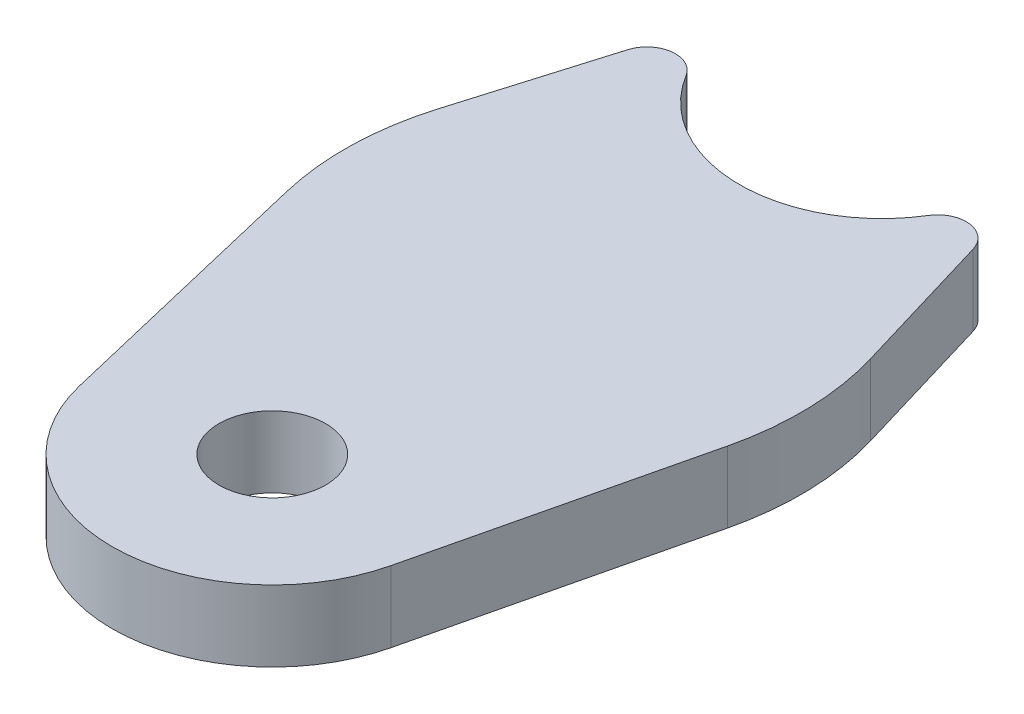
ISO-10303-21;
HEADER;
FILE_DESCRIPTION(('STEP AP214'),'2;1');
FILE_NAME('part.step','',(''),(''),'','','');
FILE_SCHEMA(('AUTOMOTIVE_DESIGN { 1 0 10303 214 1 1 1 1 }'));
ENDSEC;
DATA;
#1=APPLICATION_CONTEXT('core data for automotive mechanical design processes');
#2=APPLICATION_PROTOCOL_DEFINITION('international standard','automotive_design',2000,#1);
#3=PRODUCT_CONTEXT('',#1,'mechanical');
#4=PRODUCT('Part','Part','',(#3));
#5=PRODUCT_RELATED_PRODUCT_CATEGORY('part','',(#4));
#6=PRODUCT_DEFINITION_FORMATION('','',#4);
#7=PRODUCT_DEFINITION_CONTEXT('part definition',#1,'design');
#8=PRODUCT_DEFINITION('design','',#6,#7);
#9=PRODUCT_DEFINITION_SHAPE('','',#8);
#10=(LENGTH_UNIT() NAMED_UNIT(*) SI_UNIT(.MILLI.,.METRE.));
#11=(NAMED_UNIT(*) PLANE_ANGLE_UNIT() SI_UNIT($,.RADIAN.));
#12=(NAMED_UNIT(*) SI_UNIT($,.STERADIAN.) SOLID_ANGLE_UNIT());
#13=UNCERTAINTY_MEASURE_WITH_UNIT(LENGTH_MEASURE(1.E-05),#10,'distance_accuracy_value','');
#14=(GEOMETRIC_REPRESENTATION_CONTEXT(3) GLOBAL_UNCERTAINTY_ASSIGNED_CONTEXT((#13)) GLOBAL_UNIT_ASSIGNED_CONTEXT((#10,
#11,#12)) REPRESENTATION_CONTEXT('',''));
#15=CARTESIAN_POINT('',(0.,0.,0.));
#16=DIRECTION('',(0.,0.,1.));
#17=DIRECTION('',(1.,0.,0.));
#18=AXIS2_PLACEMENT_3D('',#15,#16,#17);
#19=CARTESIAN_POINT('',(0.,6.35,-54.4098725507521));
#20=DIRECTION('',(0.,1.,0.));
#21=DIRECTION('',(0.,0.,1.));
#22=AXIS2_PLACEMENT_3D('',#19,#20,#21);
#23=PLANE('',#22);
#24=DIRECTION('',(0.231494017970389,0.,-0.9728363272637));
#25=VECTOR('',#24,1.);
#26=CARTESIAN_POINT('',(21.2537497919373,6.35,-27.5986392399441));
#27=LINE('',#26,#25);
#28=CARTESIAN_POINT('',(13.8993990257801,6.35,3.30747078175193));
#29=VERTEX_POINT('',#28);
#30=CARTESIAN_POINT('',(19.6782224586751,6.35,-20.9776032501916));
#31=VERTEX_POINT('',#30);
#32=EDGE_CURVE('E172',#29,#31,#27,.T.);
#33=ORIENTED_EDGE('',*,*,#32,.T.);
#34=CARTESIAN_POINT('',(-5.03182025382286,6.35,-26.8575513066395));
#35=DIRECTION('',(0.,1.,0.));
#36=DIRECTION('',(0.,0.,1.));
#37=AXIS2_PLACEMENT_3D('',#34,#35,#36);
#38=CIRCLE('',#37,25.4);
#39=CARTESIAN_POINT('',(19.3076784920229,6.35,-34.1203882730718));
#40=VERTEX_POINT('',#39);
#41=EDGE_CURVE('E246',#31,#40,#38,.T.);
#42=ORIENTED_EDGE('',*,*,#41,.T.);
#43=DIRECTION('',(-0.285938463245363,0.,-0.95824798211991));
#44=VECTOR('',#43,1.);
#45=CARTESIAN_POINT('',(12.1697493729229,6.35,-58.0412910339682));
#46=LINE('',#45,#44);
#47=CARTESIAN_POINT('',(15.4177888062111,6.35,-47.1563362871718));
#48=VERTEX_POINT('',#47);
#49=EDGE_CURVE('E175',#40,#48,#46,.T.);
#50=ORIENTED_EDGE('',*,*,#49,.T.);
#51=CARTESIAN_POINT('',(12.9838389316265,6.35,-46.4300525905285));
#52=DIRECTION('',(0.,1.,0.));
#53=DIRECTION('',(0.,0.,1.));
#54=AXIS2_PLACEMENT_3D('',#51,#52,#53);
#55=CIRCLE('',#54,2.54);
#56=CARTESIAN_POINT('',(10.8198657763554,6.35,-47.7600225838991));
#57=VERTEX_POINT('',#56);
#58=EDGE_CURVE('E224',#48,#57,#55,.T.);
#59=ORIENTED_EDGE('',*,*,#58,.T.);
#60=CARTESIAN_POINT('',(0.,6.35,-54.4098725507521));
#61=DIRECTION('',(0.,-1.,0.));
#62=DIRECTION('',(0.,0.,1.));
#63=AXIS2_PLACEMENT_3D('',#60,#61,#62);
#64=CIRCLE('',#63,12.7);
#65=CARTESIAN_POINT('',(-10.8198657763554,6.35,-47.7600225838992));
#66=VERTEX_POINT('',#65);
#67=EDGE_CURVE('E201',#57,#66,#64,.T.);
#68=ORIENTED_EDGE('',*,*,#67,.T.);
#69=CARTESIAN_POINT('',(-12.9838389316265,6.35,-46.4300525905286));
#70=DIRECTION('',(0.,1.,0.));
#71=DIRECTION('',(0.,0.,1.));
#72=AXIS2_PLACEMENT_3D('',#69,#70,#71);
#73=CIRCLE('',#72,2.54);
#74=CARTESIAN_POINT('',(-15.417788806211,6.35,-47.1563362871718));
#75=VERTEX_POINT('',#74);
#76=EDGE_CURVE('E221',#66,#75,#73,.T.);
#77=ORIENTED_EDGE('',*,*,#76,.T.);
#78=DIRECTION('',(-0.285938463245363,0.,0.95824798211991));
#79=VECTOR('',#78,1.);
#80=CARTESIAN_POINT('',(-12.1697493729229,6.35,-58.0412910339682));
#81=LINE('',#80,#79);
#82=CARTESIAN_POINT('',(-19.3076784920229,6.35,-34.1203882730718));
#83=VERTEX_POINT('',#82);
#84=EDGE_CURVE('E155',#75,#83,#81,.T.);
#85=ORIENTED_EDGE('',*,*,#84,.T.);
#86=CARTESIAN_POINT('',(5.03182025382287,6.35,-26.8575513066395));
#87=DIRECTION('',(0.,1.,0.));
#88=DIRECTION('',(0.,0.,1.));
#89=AXIS2_PLACEMENT_3D('',#86,#87,#88);
#90=CIRCLE('',#89,25.4);
#91=CARTESIAN_POINT('',(-19.6782224586751,6.35,-20.9776032501916));
#92=VERTEX_POINT('',#91);
#93=EDGE_CURVE('E68',#83,#92,#90,.T.);
#94=ORIENTED_EDGE('',*,*,#93,.T.);
#95=DIRECTION('',(0.231494017970389,0.,0.9728363272637));
#96=VECTOR('',#95,1.);
#97=CARTESIAN_POINT('',(-21.2537497919373,6.35,-27.5986392399441));
#98=LINE('',#97,#96);
#99=CARTESIAN_POINT('',(-13.8993990257801,6.35,3.30747078175194));
#100=VERTEX_POINT('',#99);
#101=EDGE_CURVE('E144',#92,#100,#98,.T.);
#102=ORIENTED_EDGE('',*,*,#101,.T.);
#103=CARTESIAN_POINT('',(0.,6.35,0.));
#104=DIRECTION('',(0.,1.,0.));
#105=DIRECTION('',(0.,0.,-1.));
#106=AXIS2_PLACEMENT_3D('',#103,#104,#105);
#107=CIRCLE('',#106,14.2875);
#108=EDGE_CURVE('E149',#100,#29,#107,.T.);
#109=ORIENTED_EDGE('',*,*,#108,.T.);
#110=EDGE_LOOP('',(#33,#42,#50,#59,#68,#77,#85,#94,#102,#109));
#111=FACE_BOUND('',#110,.T.);
#112=CARTESIAN_POINT('',(0.,6.35,0.));
#113=DIRECTION('',(0.,1.,0.));
#114=DIRECTION('',(0.,0.,1.));
#115=AXIS2_PLACEMENT_3D('',#112,#113,#114);
#116=CIRCLE('',#115,4.7625);
#117=CARTESIAN_POINT('',(0.,6.35,4.7625));
#118=VERTEX_POINT('',#117);
#119=EDGE_CURVE('E186',#118,#118,#116,.T.);
#120=ORIENTED_EDGE('',*,*,#119,.F.);
#121=EDGE_LOOP('',(#120));
#122=FACE_BOUND('',#121,.T.);
#123=ADVANCED_FACE('F49',(#111,#122),#23,.T.);
#124=CARTESIAN_POINT('',(0.,0.,-54.4098725507521));
#125=DIRECTION('',(0.,1.,0.));
#126=DIRECTION('',(0.,0.,1.));
#127=AXIS2_PLACEMENT_3D('',#124,#125,#126);
#128=PLANE('',#127);
#129=DIRECTION('',(-0.285938463245363,0.,-0.95824798211991));
#130=VECTOR('',#129,1.);
#131=CARTESIAN_POINT('',(12.1697493729229,0.,-58.0412910339682));
#132=LINE('',#131,#130);
#133=CARTESIAN_POINT('',(19.3076784920229,0.,-34.1203882730718));
#134=VERTEX_POINT('',#133);
#135=CARTESIAN_POINT('',(15.4177888062111,0.,-47.1563362871718));
#136=VERTEX_POINT('',#135);
#137=EDGE_CURVE('E198',#134,#136,#132,.T.);
#138=ORIENTED_EDGE('',*,*,#137,.F.);
#139=CARTESIAN_POINT('',(-5.03182025382286,0.,-26.8575513066395));
#140=DIRECTION('',(0.,1.,0.));
#141=DIRECTION('',(0.,0.,1.));
#142=AXIS2_PLACEMENT_3D('',#139,#140,#141);
#143=CIRCLE('',#142,25.4);
#144=CARTESIAN_POINT('',(19.6782224586751,0.,-20.9776032501916));
#145=VERTEX_POINT('',#144);
#146=EDGE_CURVE('E238',#134,#145,#143,.F.);
#147=ORIENTED_EDGE('',*,*,#146,.T.);
#148=DIRECTION('',(0.231494017970389,0.,-0.9728363272637));
#149=VECTOR('',#148,1.);
#150=CARTESIAN_POINT('',(21.2537497919373,0.,-27.5986392399441));
#151=LINE('',#150,#149);
#152=CARTESIAN_POINT('',(13.8993990257801,0.,3.30747078175193));
#153=VERTEX_POINT('',#152);
#154=EDGE_CURVE('E194',#153,#145,#151,.T.);
#155=ORIENTED_EDGE('',*,*,#154,.F.);
#156=CARTESIAN_POINT('',(0.,0.,0.));
#157=DIRECTION('',(0.,1.,0.));
#158=DIRECTION('',(0.,0.,-1.));
#159=AXIS2_PLACEMENT_3D('',#156,#157,#158);
#160=CIRCLE('',#159,14.2875);
#161=CARTESIAN_POINT('',(-13.8993990257801,0.,3.30747078175194));
#162=VERTEX_POINT('',#161);
#163=EDGE_CURVE('E191',#162,#153,#160,.T.);
#164=ORIENTED_EDGE('',*,*,#163,.F.);
#165=DIRECTION('',(0.231494017970389,0.,0.9728363272637));
#166=VECTOR('',#165,1.);
#167=CARTESIAN_POINT('',(-21.2537497919373,0.,-27.5986392399441));
#168=LINE('',#167,#166);
#169=CARTESIAN_POINT('',(-19.6782224586751,0.,-20.9776032501916));
#170=VERTEX_POINT('',#169);
#171=EDGE_CURVE('E161',#170,#162,#168,.T.);
#172=ORIENTED_EDGE('',*,*,#171,.F.);
#173=CARTESIAN_POINT('',(5.03182025382287,0.,-26.8575513066395));
#174=DIRECTION('',(0.,1.,0.));
#175=DIRECTION('',(0.,0.,1.));
#176=AXIS2_PLACEMENT_3D('',#173,#174,#175);
#177=CIRCLE('',#176,25.4);
#178=CARTESIAN_POINT('',(-19.3076784920229,0.,-34.1203882730718));
#179=VERTEX_POINT('',#178);
#180=EDGE_CURVE('E235',#170,#179,#177,.F.);
#181=ORIENTED_EDGE('',*,*,#180,.T.);
#182=DIRECTION('',(-0.285938463245363,0.,0.95824798211991));
#183=VECTOR('',#182,1.);
#184=CARTESIAN_POINT('',(-12.1697493729229,0.,-58.0412910339682));
#185=LINE('',#184,#183);
#186=CARTESIAN_POINT('',(-15.417788806211,0.,-47.1563362871718));
#187=VERTEX_POINT('',#186);
#188=EDGE_CURVE('E185',#187,#179,#185,.T.);
#189=ORIENTED_EDGE('',*,*,#188,.F.);
#190=CARTESIAN_POINT('',(-12.9838389316265,0.,-46.4300525905286));
#191=DIRECTION('',(0.,1.,0.));
#192=DIRECTION('',(0.,0.,1.));
#193=AXIS2_PLACEMENT_3D('',#190,#191,#192);
#194=CIRCLE('',#193,2.54);
#195=CARTESIAN_POINT('',(-10.8198657763554,0.,-47.7600225838992));
#196=VERTEX_POINT('',#195);
#197=EDGE_CURVE('E210',#187,#196,#194,.F.);
#198=ORIENTED_EDGE('',*,*,#197,.T.);
#199=CARTESIAN_POINT('',(0.,0.,-54.4098725507521));
#200=DIRECTION('',(0.,-1.,0.));
#201=DIRECTION('',(0.,0.,1.));
#202=AXIS2_PLACEMENT_3D('',#199,#200,#201);
#203=CIRCLE('',#202,12.7);
#204=CARTESIAN_POINT('',(10.8198657763554,0.,-47.7600225838991));
#205=VERTEX_POINT('',#204);
#206=EDGE_CURVE('E181',#205,#196,#203,.T.);
#207=ORIENTED_EDGE('',*,*,#206,.F.);
#208=CARTESIAN_POINT('',(12.9838389316265,0.,-46.4300525905285));
#209=DIRECTION('',(0.,1.,0.));
#210=DIRECTION('',(0.,0.,1.));
#211=AXIS2_PLACEMENT_3D('',#208,#209,#210);
#212=CIRCLE('',#211,2.54);
#213=EDGE_CURVE('E213',#205,#136,#212,.F.);
#214=ORIENTED_EDGE('',*,*,#213,.T.);
#215=EDGE_LOOP('',(#138,#147,#155,#164,#172,#181,#189,#198,#207,#214));
#216=FACE_BOUND('',#215,.T.);
#217=CARTESIAN_POINT('',(0.,0.,0.));
#218=DIRECTION('',(0.,1.,0.));
#219=DIRECTION('',(0.,0.,1.));
#220=AXIS2_PLACEMENT_3D('',#217,#218,#219);
#221=CIRCLE('',#220,4.7625);
#222=CARTESIAN_POINT('',(0.,0.,4.7625));
#223=VERTEX_POINT('',#222);
#224=EDGE_CURVE('E282',#223,#223,#221,.T.);
#225=ORIENTED_EDGE('',*,*,#224,.T.);
#226=EDGE_LOOP('',(#225));
#227=FACE_BOUND('',#226,.T.);
#228=ADVANCED_FACE('F252',(#216,#227),#128,.F.);
#229=CARTESIAN_POINT('',(0.,6.35,-54.4098725507521));
#230=DIRECTION('',(0.,-1.,0.));
#231=DIRECTION('',(0.,0.,-1.));
#232=AXIS2_PLACEMENT_3D('',#229,#230,#231);
#233=CYLINDRICAL_SURFACE('',#232,12.7);
#234=ORIENTED_EDGE('',*,*,#67,.F.);
#235=DIRECTION('',(0.,-1.,0.));
#236=VECTOR('',#235,1.);
#237=CARTESIAN_POINT('',(10.8198657763554,6.35,-47.7600225838991));
#238=LINE('',#237,#236);
#239=EDGE_CURVE('E206',#57,#205,#238,.T.);
#240=ORIENTED_EDGE('',*,*,#239,.T.);
#241=ORIENTED_EDGE('',*,*,#206,.T.);
#242=DIRECTION('',(0.,-1.,0.));
#243=VECTOR('',#242,1.);
#244=CARTESIAN_POINT('',(-10.8198657763554,6.35,-47.7600225838992));
#245=LINE('',#244,#243);
#246=EDGE_CURVE('E165',#196,#66,#245,.F.);
#247=ORIENTED_EDGE('',*,*,#246,.T.);
#248=EDGE_LOOP('',(#234,#240,#241,#247));
#249=FACE_BOUND('',#248,.T.);
#250=ADVANCED_FACE('F276',(#249),#233,.F.);
#251=CARTESIAN_POINT('',(-12.1697493729229,6.35,-58.0412910339682));
#252=DIRECTION('',(0.95824798211991,0.,0.285938463245363));
#253=DIRECTION('',(0.285938463245363,0.,-0.95824798211991));
#254=AXIS2_PLACEMENT_3D('',#251,#252,#253);
#255=PLANE('',#254);
#256=ORIENTED_EDGE('',*,*,#188,.T.);
#257=DIRECTION('',(0.,-1.,0.));
#258=VECTOR('',#257,1.);
#259=CARTESIAN_POINT('',(-19.3076784920229,6.35,-34.1203882730717));
#260=LINE('',#259,#258);
#261=EDGE_CURVE('E11',#179,#83,#260,.F.);
#262=ORIENTED_EDGE('',*,*,#261,.T.);
#263=ORIENTED_EDGE('',*,*,#84,.F.);
#264=DIRECTION('',(0.,-1.,0.));
#265=VECTOR('',#264,1.);
#266=CARTESIAN_POINT('',(-15.417788806211,6.35,-47.1563362871718));
#267=LINE('',#266,#265);
#268=EDGE_CURVE('E227',#75,#187,#267,.T.);
#269=ORIENTED_EDGE('',*,*,#268,.T.);
#270=EDGE_LOOP('',(#256,#262,#263,#269));
#271=FACE_BOUND('',#270,.T.);
#272=ADVANCED_FACE('F308',(#271),#255,.F.);
#273=CARTESIAN_POINT('',(-21.2537497919373,6.35,-27.5986392399441));
#274=DIRECTION('',(0.9728363272637,0.,-0.231494017970389));
#275=DIRECTION('',(-0.231494017970389,0.,-0.9728363272637));
#276=AXIS2_PLACEMENT_3D('',#273,#274,#275);
#277=PLANE('',#276);
#278=ORIENTED_EDGE('',*,*,#101,.F.);
#279=DIRECTION('',(0.,-1.,0.));
#280=VECTOR('',#279,1.);
#281=CARTESIAN_POINT('',(-19.6782224586751,6.35,-20.9776032501916));
#282=LINE('',#281,#280);
#283=EDGE_CURVE('E58',#92,#170,#282,.T.);
#284=ORIENTED_EDGE('',*,*,#283,.T.);
#285=ORIENTED_EDGE('',*,*,#171,.T.);
#286=DIRECTION('',(0.,-1.,0.));
#287=VECTOR('',#286,1.);
#288=CARTESIAN_POINT('',(-13.8993990257801,6.35,3.30747078175194));
#289=LINE('',#288,#287);
#290=EDGE_CURVE('E158',#100,#162,#289,.T.);
#291=ORIENTED_EDGE('',*,*,#290,.F.);
#292=EDGE_LOOP('',(#278,#284,#285,#291));
#293=FACE_BOUND('',#292,.T.);
#294=ADVANCED_FACE('F159',(#293),#277,.F.);
#295=CARTESIAN_POINT('',(0.,6.35,0.));
#296=DIRECTION('',(0.,-1.,0.));
#297=DIRECTION('',(0.,0.,-1.));
#298=AXIS2_PLACEMENT_3D('',#295,#296,#297);
#299=CYLINDRICAL_SURFACE('',#298,14.2875);
#300=ORIENTED_EDGE('',*,*,#163,.T.);
#301=DIRECTION('',(0.,-1.,0.));
#302=VECTOR('',#301,1.);
#303=CARTESIAN_POINT('',(13.8993990257801,6.35,3.30747078175193));
#304=LINE('',#303,#302);
#305=EDGE_CURVE('E166',#29,#153,#304,.T.);
#306=ORIENTED_EDGE('',*,*,#305,.F.);
#307=ORIENTED_EDGE('',*,*,#108,.F.);
#308=ORIENTED_EDGE('',*,*,#290,.T.);
#309=EDGE_LOOP('',(#300,#306,#307,#308));
#310=FACE_BOUND('',#309,.T.);
#311=ADVANCED_FACE('F168',(#310),#299,.T.);
#312=CARTESIAN_POINT('',(21.2537497919373,6.35,-27.5986392399441));
#313=DIRECTION('',(-0.9728363272637,0.,-0.231494017970389));
#314=DIRECTION('',(-0.231494017970389,0.,0.9728363272637));
#315=AXIS2_PLACEMENT_3D('',#312,#313,#314);
#316=PLANE('',#315);
#317=ORIENTED_EDGE('',*,*,#154,.T.);
#318=DIRECTION('',(0.,-1.,0.));
#319=VECTOR('',#318,1.);
#320=CARTESIAN_POINT('',(19.6782224586751,6.35,-20.9776032501916));
#321=LINE('',#320,#319);
#322=EDGE_CURVE('E241',#145,#31,#321,.F.);
#323=ORIENTED_EDGE('',*,*,#322,.T.);
#324=ORIENTED_EDGE('',*,*,#32,.F.);
#325=ORIENTED_EDGE('',*,*,#305,.T.);
#326=EDGE_LOOP('',(#317,#323,#324,#325));
#327=FACE_BOUND('',#326,.T.);
#328=ADVANCED_FACE('F257',(#327),#316,.F.);
#329=CARTESIAN_POINT('',(12.1697493729229,6.35,-58.0412910339682));
#330=DIRECTION('',(-0.95824798211991,0.,0.285938463245363));
#331=DIRECTION('',(0.285938463245363,0.,0.95824798211991));
#332=AXIS2_PLACEMENT_3D('',#329,#330,#331);
#333=PLANE('',#332);
#334=ORIENTED_EDGE('',*,*,#49,.F.);
#335=DIRECTION('',(0.,-1.,0.));
#336=VECTOR('',#335,1.);
#337=CARTESIAN_POINT('',(19.3076784920229,6.35,-34.1203882730717));
#338=LINE('',#337,#336);
#339=EDGE_CURVE('E231',#40,#134,#338,.T.);
#340=ORIENTED_EDGE('',*,*,#339,.T.);
#341=ORIENTED_EDGE('',*,*,#137,.T.);
#342=DIRECTION('',(0.,-1.,0.));
#343=VECTOR('',#342,1.);
#344=CARTESIAN_POINT('',(15.4177888062111,6.35,-47.1563362871718));
#345=LINE('',#344,#343);
#346=EDGE_CURVE('E217',#136,#48,#345,.F.);
#347=ORIENTED_EDGE('',*,*,#346,.T.);
#348=EDGE_LOOP('',(#334,#340,#341,#347));
#349=FACE_BOUND('',#348,.T.);
#350=ADVANCED_FACE('F265',(#349),#333,.F.);
#351=CARTESIAN_POINT('',(0.,6.35,0.));
#352=DIRECTION('',(0.,-1.,0.));
#353=DIRECTION('',(0.,0.,-1.));
#354=AXIS2_PLACEMENT_3D('',#351,#352,#353);
#355=CYLINDRICAL_SURFACE('',#354,4.7625);
#356=ORIENTED_EDGE('',*,*,#119,.T.);
#357=EDGE_LOOP('',(#356));
#358=FACE_BOUND('',#357,.T.);
#359=ORIENTED_EDGE('',*,*,#224,.F.);
#360=EDGE_LOOP('',(#359));
#361=FACE_BOUND('',#360,.T.);
#362=ADVANCED_FACE('F290',(#358,#361),#355,.F.);
#363=CARTESIAN_POINT('',(12.9838389316265,6.35,-46.4300525905285));
#364=DIRECTION('',(0.,-1.,0.));
#365=DIRECTION('',(0.,0.,-1.));
#366=AXIS2_PLACEMENT_3D('',#363,#364,#365);
#367=CYLINDRICAL_SURFACE('',#366,2.54);
#368=ORIENTED_EDGE('',*,*,#58,.F.);
#369=ORIENTED_EDGE('',*,*,#346,.F.);
#370=ORIENTED_EDGE('',*,*,#213,.F.);
#371=ORIENTED_EDGE('',*,*,#239,.F.);
#372=EDGE_LOOP('',(#368,#369,#370,#371));
#373=FACE_BOUND('',#372,.T.);
#374=ADVANCED_FACE('F271',(#373),#367,.T.);
#375=CARTESIAN_POINT('',(-12.9838389316265,6.35,-46.4300525905286));
#376=DIRECTION('',(0.,-1.,0.));
#377=DIRECTION('',(0.,0.,-1.));
#378=AXIS2_PLACEMENT_3D('',#375,#376,#377);
#379=CYLINDRICAL_SURFACE('',#378,2.54);
#380=ORIENTED_EDGE('',*,*,#76,.F.);
#381=ORIENTED_EDGE('',*,*,#246,.F.);
#382=ORIENTED_EDGE('',*,*,#197,.F.);
#383=ORIENTED_EDGE('',*,*,#268,.F.);
#384=EDGE_LOOP('',(#380,#381,#382,#383));
#385=FACE_BOUND('',#384,.T.);
#386=ADVANCED_FACE('F314',(#385),#379,.T.);
#387=CARTESIAN_POINT('',(-5.03182025382286,6.35,-26.8575513066395));
#388=DIRECTION('',(0.,-1.,0.));
#389=DIRECTION('',(0.,0.,-1.));
#390=AXIS2_PLACEMENT_3D('',#387,#388,#389);
#391=CYLINDRICAL_SURFACE('',#390,25.4);
#392=ORIENTED_EDGE('',*,*,#41,.F.);
#393=ORIENTED_EDGE('',*,*,#322,.F.);
#394=ORIENTED_EDGE('',*,*,#146,.F.);
#395=ORIENTED_EDGE('',*,*,#339,.F.);
#396=EDGE_LOOP('',(#392,#393,#394,#395));
#397=FACE_BOUND('',#396,.T.);
#398=ADVANCED_FACE('F263',(#397),#391,.T.);
#399=CARTESIAN_POINT('',(5.03182025382287,6.35,-26.8575513066395));
#400=DIRECTION('',(0.,-1.,0.));
#401=DIRECTION('',(0.,0.,-1.));
#402=AXIS2_PLACEMENT_3D('',#399,#400,#401);
#403=CYLINDRICAL_SURFACE('',#402,25.4);
#404=ORIENTED_EDGE('',*,*,#93,.F.);
#405=ORIENTED_EDGE('',*,*,#261,.F.);
#406=ORIENTED_EDGE('',*,*,#180,.F.);
#407=ORIENTED_EDGE('',*,*,#283,.F.);
#408=EDGE_LOOP('',(#404,#405,#406,#407));
#409=FACE_BOUND('',#408,.T.);
#410=ADVANCED_FACE('F51',(#409),#403,.T.);
#411=CLOSED_SHELL('',(#123,#228,#250,#272,#294,#311,#328,#350,#362,#374,#386,#398,#410));
#412=MANIFOLD_SOLID_BREP('B2',#411);
#413=ADVANCED_BREP_SHAPE_REPRESENTATION('',(#18,#412),#14);
#414=SHAPE_DEFINITION_REPRESENTATION(#9,#413);
ENDSEC;
END-ISO-10303-21;
